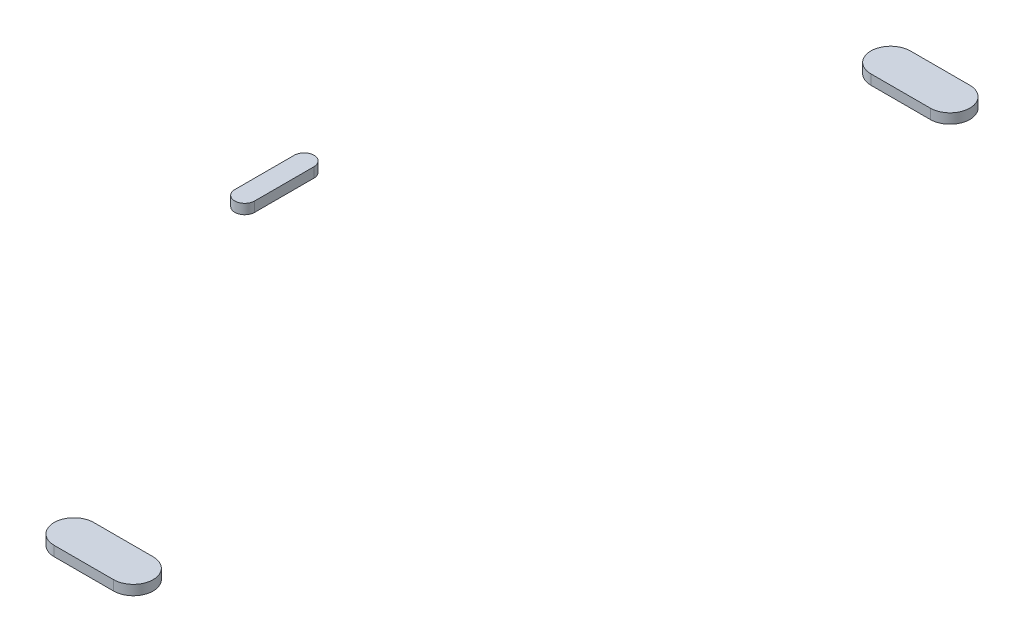
ISO-10303-21;
HEADER;
FILE_DESCRIPTION(('STEP AP214'),'2;1');
FILE_NAME('part.step','',(''),(''),'','','');
FILE_SCHEMA(('AUTOMOTIVE_DESIGN { 1 0 10303 214 1 1 1 1 }'));
ENDSEC;
DATA;
#1=APPLICATION_CONTEXT('core data for automotive mechanical design processes');
#2=APPLICATION_PROTOCOL_DEFINITION('international standard','automotive_design',2000,#1);
#3=PRODUCT_CONTEXT('',#1,'mechanical');
#4=PRODUCT('Part','Part','',(#3));
#5=PRODUCT_RELATED_PRODUCT_CATEGORY('part','',(#4));
#6=PRODUCT_DEFINITION_FORMATION('','',#4);
#7=PRODUCT_DEFINITION_CONTEXT('part definition',#1,'design');
#8=PRODUCT_DEFINITION('design','',#6,#7);
#9=PRODUCT_DEFINITION_SHAPE('','',#8);
#10=(LENGTH_UNIT() NAMED_UNIT(*) SI_UNIT(.MILLI.,.METRE.));
#11=(NAMED_UNIT(*) PLANE_ANGLE_UNIT() SI_UNIT($,.RADIAN.));
#12=(NAMED_UNIT(*) SI_UNIT($,.STERADIAN.) SOLID_ANGLE_UNIT());
#13=UNCERTAINTY_MEASURE_WITH_UNIT(LENGTH_MEASURE(1.E-05),#10,'distance_accuracy_value','');
#14=(GEOMETRIC_REPRESENTATION_CONTEXT(3) GLOBAL_UNCERTAINTY_ASSIGNED_CONTEXT((#13)) GLOBAL_UNIT_ASSIGNED_CONTEXT((#10,
#11,#12)) REPRESENTATION_CONTEXT('',''));
#15=CARTESIAN_POINT('',(0.,0.,0.));
#16=DIRECTION('',(0.,0.,1.));
#17=DIRECTION('',(1.,0.,0.));
#18=AXIS2_PLACEMENT_3D('',#15,#16,#17);
#19=CARTESIAN_POINT('',(0.,-342.9,-249.2375));
#20=DIRECTION('',(0.,0.,1.));
#21=DIRECTION('',(-1.,0.,0.));
#22=AXIS2_PLACEMENT_3D('',#19,#20,#21);
#23=PLANE('',#22);
#24=DIRECTION('',(-1.,0.,0.));
#25=VECTOR('',#24,1.);
#26=CARTESIAN_POINT('',(0.,-336.55,-249.2375));
#27=LINE('',#26,#25);
#28=CARTESIAN_POINT('',(171.45,-336.55,-249.2375));
#29=VERTEX_POINT('',#28);
#30=CARTESIAN_POINT('',(133.35,-336.55,-249.2375));
#31=VERTEX_POINT('',#30);
#32=EDGE_CURVE('E112',#29,#31,#27,.T.);
#33=ORIENTED_EDGE('',*,*,#32,.T.);
#34=DIRECTION('',(0.,1.,0.));
#35=VECTOR('',#34,1.);
#36=CARTESIAN_POINT('',(133.35,-342.9,-249.2375));
#37=LINE('',#36,#35);
#38=CARTESIAN_POINT('',(133.35,-342.9,-249.2375));
#39=VERTEX_POINT('',#38);
#40=EDGE_CURVE('E51',#39,#31,#37,.T.);
#41=ORIENTED_EDGE('',*,*,#40,.F.);
#42=DIRECTION('',(-1.,0.,0.));
#43=VECTOR('',#42,1.);
#44=CARTESIAN_POINT('',(0.,-342.9,-249.2375));
#45=LINE('',#44,#43);
#46=CARTESIAN_POINT('',(171.45,-342.9,-249.2375));
#47=VERTEX_POINT('',#46);
#48=EDGE_CURVE('E101',#47,#39,#45,.T.);
#49=ORIENTED_EDGE('',*,*,#48,.F.);
#50=DIRECTION('',(0.,1.,0.));
#51=VECTOR('',#50,1.);
#52=CARTESIAN_POINT('',(171.45,-342.9,-249.2375));
#53=LINE('',#52,#51);
#54=EDGE_CURVE('E12',#47,#29,#53,.T.);
#55=ORIENTED_EDGE('',*,*,#54,.T.);
#56=EDGE_LOOP('',(#33,#41,#49,#55));
#57=FACE_BOUND('',#56,.T.);
#58=ADVANCED_FACE('F48',(#57),#23,.T.);
#59=CARTESIAN_POINT('',(171.45,-342.9,-261.9375));
#60=DIRECTION('',(0.,1.,0.));
#61=DIRECTION('',(0.,0.,-1.));
#62=AXIS2_PLACEMENT_3D('',#59,#60,#61);
#63=CYLINDRICAL_SURFACE('',#62,12.7);
#64=CARTESIAN_POINT('',(171.45,-336.55,-261.9375));
#65=DIRECTION('',(0.,-1.,0.));
#66=DIRECTION('',(0.,0.,-1.));
#67=AXIS2_PLACEMENT_3D('',#64,#65,#66);
#68=CIRCLE('',#67,12.7);
#69=CARTESIAN_POINT('',(171.45,-336.55,-274.6375));
#70=VERTEX_POINT('',#69);
#71=EDGE_CURVE('E89',#70,#29,#68,.T.);
#72=ORIENTED_EDGE('',*,*,#71,.T.);
#73=ORIENTED_EDGE('',*,*,#54,.F.);
#74=CARTESIAN_POINT('',(171.45,-342.9,-261.9375));
#75=DIRECTION('',(0.,-1.,0.));
#76=DIRECTION('',(0.,0.,-1.));
#77=AXIS2_PLACEMENT_3D('',#74,#75,#76);
#78=CIRCLE('',#77,12.7);
#79=CARTESIAN_POINT('',(171.45,-342.9,-274.6375));
#80=VERTEX_POINT('',#79);
#81=EDGE_CURVE('E66',#80,#47,#78,.T.);
#82=ORIENTED_EDGE('',*,*,#81,.F.);
#83=DIRECTION('',(0.,1.,0.));
#84=VECTOR('',#83,1.);
#85=CARTESIAN_POINT('',(171.45,-342.9,-274.6375));
#86=LINE('',#85,#84);
#87=EDGE_CURVE('E57',#80,#70,#86,.T.);
#88=ORIENTED_EDGE('',*,*,#87,.T.);
#89=EDGE_LOOP('',(#72,#73,#82,#88));
#90=FACE_BOUND('',#89,.T.);
#91=ADVANCED_FACE('F118',(#90),#63,.T.);
#92=CARTESIAN_POINT('',(0.,-342.9,-274.6375));
#93=DIRECTION('',(0.,0.,1.));
#94=DIRECTION('',(-1.,0.,0.));
#95=AXIS2_PLACEMENT_3D('',#92,#93,#94);
#96=PLANE('',#95);
#97=DIRECTION('',(-1.,0.,0.));
#98=VECTOR('',#97,1.);
#99=CARTESIAN_POINT('',(0.,-336.55,-274.6375));
#100=LINE('',#99,#98);
#101=CARTESIAN_POINT('',(133.35,-336.55,-274.6375));
#102=VERTEX_POINT('',#101);
#103=EDGE_CURVE('E83',#70,#102,#100,.T.);
#104=ORIENTED_EDGE('',*,*,#103,.F.);
#105=ORIENTED_EDGE('',*,*,#87,.F.);
#106=DIRECTION('',(-1.,0.,0.));
#107=VECTOR('',#106,1.);
#108=CARTESIAN_POINT('',(0.,-342.9,-274.6375));
#109=LINE('',#108,#107);
#110=CARTESIAN_POINT('',(133.35,-342.9,-274.6375));
#111=VERTEX_POINT('',#110);
#112=EDGE_CURVE('E99',#80,#111,#109,.T.);
#113=ORIENTED_EDGE('',*,*,#112,.T.);
#114=DIRECTION('',(0.,1.,0.));
#115=VECTOR('',#114,1.);
#116=CARTESIAN_POINT('',(133.35,-342.9,-274.6375));
#117=LINE('',#116,#115);
#118=EDGE_CURVE('E104',#111,#102,#117,.T.);
#119=ORIENTED_EDGE('',*,*,#118,.T.);
#120=EDGE_LOOP('',(#104,#105,#113,#119));
#121=FACE_BOUND('',#120,.T.);
#122=ADVANCED_FACE('F107',(#121),#96,.F.);
#123=CARTESIAN_POINT('',(133.35,-342.9,-261.9375));
#124=DIRECTION('',(0.,1.,0.));
#125=DIRECTION('',(0.,0.,-1.));
#126=AXIS2_PLACEMENT_3D('',#123,#124,#125);
#127=CYLINDRICAL_SURFACE('',#126,12.7);
#128=CARTESIAN_POINT('',(133.35,-336.55,-261.9375));
#129=DIRECTION('',(0.,-1.,0.));
#130=DIRECTION('',(0.,0.,-1.));
#131=AXIS2_PLACEMENT_3D('',#128,#129,#130);
#132=CIRCLE('',#131,12.7);
#133=EDGE_CURVE('E106',#31,#102,#132,.T.);
#134=ORIENTED_EDGE('',*,*,#133,.T.);
#135=ORIENTED_EDGE('',*,*,#118,.F.);
#136=CARTESIAN_POINT('',(133.35,-342.9,-261.9375));
#137=DIRECTION('',(0.,-1.,0.));
#138=DIRECTION('',(0.,0.,-1.));
#139=AXIS2_PLACEMENT_3D('',#136,#137,#138);
#140=CIRCLE('',#139,12.7);
#141=EDGE_CURVE('E96',#39,#111,#140,.T.);
#142=ORIENTED_EDGE('',*,*,#141,.F.);
#143=ORIENTED_EDGE('',*,*,#40,.T.);
#144=EDGE_LOOP('',(#134,#135,#142,#143));
#145=FACE_BOUND('',#144,.T.);
#146=ADVANCED_FACE('F105',(#145),#127,.T.);
#147=CARTESIAN_POINT('',(0.,-342.9,0.));
#148=DIRECTION('',(0.,1.,0.));
#149=DIRECTION('',(0.,0.,-1.));
#150=AXIS2_PLACEMENT_3D('',#147,#148,#149);
#151=PLANE('',#150);
#152=ORIENTED_EDGE('',*,*,#48,.T.);
#153=ORIENTED_EDGE('',*,*,#141,.T.);
#154=ORIENTED_EDGE('',*,*,#112,.F.);
#155=ORIENTED_EDGE('',*,*,#81,.T.);
#156=EDGE_LOOP('',(#152,#153,#154,#155));
#157=FACE_BOUND('',#156,.T.);
#158=ADVANCED_FACE('F97',(#157),#151,.F.);
#159=CARTESIAN_POINT('',(0.,-336.55,0.));
#160=DIRECTION('',(0.,1.,0.));
#161=DIRECTION('',(0.,0.,-1.));
#162=AXIS2_PLACEMENT_3D('',#159,#160,#161);
#163=PLANE('',#162);
#164=ORIENTED_EDGE('',*,*,#32,.F.);
#165=ORIENTED_EDGE('',*,*,#71,.F.);
#166=ORIENTED_EDGE('',*,*,#103,.T.);
#167=ORIENTED_EDGE('',*,*,#133,.F.);
#168=EDGE_LOOP('',(#164,#165,#166,#167));
#169=FACE_BOUND('',#168,.T.);
#170=ADVANCED_FACE('F121',(#169),#163,.T.);
#171=CLOSED_SHELL('',(#58,#91,#122,#146,#158,#170));
#172=MANIFOLD_SOLID_BREP('B2',#171);
#173=CARTESIAN_POINT('',(0.,-342.9,19.05));
#174=DIRECTION('',(0.,1.,0.));
#175=DIRECTION('',(0.,0.,1.));
#176=AXIS2_PLACEMENT_3D('',#173,#174,#175);
#177=CYLINDRICAL_SURFACE('',#176,6.35);
#178=CARTESIAN_POINT('',(0.,-336.55,19.05));
#179=DIRECTION('',(0.,1.,0.));
#180=DIRECTION('',(0.,0.,1.));
#181=AXIS2_PLACEMENT_3D('',#178,#179,#180);
#182=CIRCLE('',#181,6.35);
#183=CARTESIAN_POINT('',(-6.35,-336.55,19.05));
#184=VERTEX_POINT('',#183);
#185=CARTESIAN_POINT('',(6.35,-336.55,19.05));
#186=VERTEX_POINT('',#185);
#187=EDGE_CURVE('E46',#184,#186,#182,.T.);
#188=ORIENTED_EDGE('',*,*,#187,.F.);
#189=DIRECTION('',(0.,1.,0.));
#190=VECTOR('',#189,1.);
#191=CARTESIAN_POINT('',(-6.35,-342.9,19.05));
#192=LINE('',#191,#190);
#193=CARTESIAN_POINT('',(-6.35,-342.9,19.05));
#194=VERTEX_POINT('',#193);
#195=EDGE_CURVE('E252',#194,#184,#192,.T.);
#196=ORIENTED_EDGE('',*,*,#195,.F.);
#197=CARTESIAN_POINT('',(0.,-342.9,19.05));
#198=DIRECTION('',(0.,1.,0.));
#199=DIRECTION('',(0.,0.,1.));
#200=AXIS2_PLACEMENT_3D('',#197,#198,#199);
#201=CIRCLE('',#200,6.35);
#202=CARTESIAN_POINT('',(6.35,-342.9,19.05));
#203=VERTEX_POINT('',#202);
#204=EDGE_CURVE('E209',#194,#203,#201,.T.);
#205=ORIENTED_EDGE('',*,*,#204,.T.);
#206=DIRECTION('',(0.,1.,0.));
#207=VECTOR('',#206,1.);
#208=CARTESIAN_POINT('',(6.35,-342.9,19.05));
#209=LINE('',#208,#207);
#210=EDGE_CURVE('E224',#203,#186,#209,.T.);
#211=ORIENTED_EDGE('',*,*,#210,.T.);
#212=EDGE_LOOP('',(#188,#196,#205,#211));
#213=FACE_BOUND('',#212,.T.);
#214=ADVANCED_FACE('F205',(#213),#177,.T.);
#215=CARTESIAN_POINT('',(-6.35,-342.9,19.05));
#216=DIRECTION('',(1.,0.,0.));
#217=DIRECTION('',(0.,0.,-1.));
#218=AXIS2_PLACEMENT_3D('',#215,#216,#217);
#219=PLANE('',#218);
#220=DIRECTION('',(0.,0.,-1.));
#221=VECTOR('',#220,1.);
#222=CARTESIAN_POINT('',(-6.35,-336.55,19.05));
#223=LINE('',#222,#221);
#224=CARTESIAN_POINT('',(-6.35000000000001,-336.55,-19.05));
#225=VERTEX_POINT('',#224);
#226=EDGE_CURVE('E263',#184,#225,#223,.T.);
#227=ORIENTED_EDGE('',*,*,#226,.T.);
#228=DIRECTION('',(0.,1.,0.));
#229=VECTOR('',#228,1.);
#230=CARTESIAN_POINT('',(-6.35000000000001,-342.9,-19.05));
#231=LINE('',#230,#229);
#232=CARTESIAN_POINT('',(-6.35000000000001,-342.9,-19.05));
#233=VERTEX_POINT('',#232);
#234=EDGE_CURVE('E256',#233,#225,#231,.T.);
#235=ORIENTED_EDGE('',*,*,#234,.F.);
#236=DIRECTION('',(0.,0.,-1.));
#237=VECTOR('',#236,1.);
#238=CARTESIAN_POINT('',(-6.35,-342.9,19.05));
#239=LINE('',#238,#237);
#240=EDGE_CURVE('E272',#194,#233,#239,.T.);
#241=ORIENTED_EDGE('',*,*,#240,.F.);
#242=ORIENTED_EDGE('',*,*,#195,.T.);
#243=EDGE_LOOP('',(#227,#235,#241,#242));
#244=FACE_BOUND('',#243,.T.);
#245=ADVANCED_FACE('F264',(#244),#219,.F.);
#246=CARTESIAN_POINT('',(0.,-342.9,-19.05));
#247=DIRECTION('',(0.,1.,0.));
#248=DIRECTION('',(0.,0.,1.));
#249=AXIS2_PLACEMENT_3D('',#246,#247,#248);
#250=CYLINDRICAL_SURFACE('',#249,6.35);
#251=CARTESIAN_POINT('',(0.,-336.55,-19.05));
#252=DIRECTION('',(0.,1.,0.));
#253=DIRECTION('',(0.,0.,1.));
#254=AXIS2_PLACEMENT_3D('',#251,#252,#253);
#255=CIRCLE('',#254,6.35);
#256=CARTESIAN_POINT('',(6.34999999999999,-336.55,-19.05));
#257=VERTEX_POINT('',#256);
#258=EDGE_CURVE('E259',#257,#225,#255,.T.);
#259=ORIENTED_EDGE('',*,*,#258,.F.);
#260=DIRECTION('',(0.,1.,0.));
#261=VECTOR('',#260,1.);
#262=CARTESIAN_POINT('',(6.34999999999999,-342.9,-19.05));
#263=LINE('',#262,#261);
#264=CARTESIAN_POINT('',(6.34999999999999,-342.9,-19.05));
#265=VERTEX_POINT('',#264);
#266=EDGE_CURVE('E241',#265,#257,#263,.T.);
#267=ORIENTED_EDGE('',*,*,#266,.F.);
#268=CARTESIAN_POINT('',(0.,-342.9,-19.05));
#269=DIRECTION('',(0.,1.,0.));
#270=DIRECTION('',(0.,0.,1.));
#271=AXIS2_PLACEMENT_3D('',#268,#269,#270);
#272=CIRCLE('',#271,6.35);
#273=EDGE_CURVE('E261',#265,#233,#272,.T.);
#274=ORIENTED_EDGE('',*,*,#273,.T.);
#275=ORIENTED_EDGE('',*,*,#234,.T.);
#276=EDGE_LOOP('',(#259,#267,#274,#275));
#277=FACE_BOUND('',#276,.T.);
#278=ADVANCED_FACE('F257',(#277),#250,.T.);
#279=CARTESIAN_POINT('',(6.35,-342.9,19.05));
#280=DIRECTION('',(1.,0.,0.));
#281=DIRECTION('',(0.,0.,-1.));
#282=AXIS2_PLACEMENT_3D('',#279,#280,#281);
#283=PLANE('',#282);
#284=DIRECTION('',(0.,0.,-1.));
#285=VECTOR('',#284,1.);
#286=CARTESIAN_POINT('',(6.35,-336.55,19.05));
#287=LINE('',#286,#285);
#288=EDGE_CURVE('E215',#186,#257,#287,.T.);
#289=ORIENTED_EDGE('',*,*,#288,.F.);
#290=ORIENTED_EDGE('',*,*,#210,.F.);
#291=DIRECTION('',(0.,0.,-1.));
#292=VECTOR('',#291,1.);
#293=CARTESIAN_POINT('',(6.35,-342.9,19.05));
#294=LINE('',#293,#292);
#295=EDGE_CURVE('E274',#203,#265,#294,.T.);
#296=ORIENTED_EDGE('',*,*,#295,.T.);
#297=ORIENTED_EDGE('',*,*,#266,.T.);
#298=EDGE_LOOP('',(#289,#290,#296,#297));
#299=FACE_BOUND('',#298,.T.);
#300=ADVANCED_FACE('F278',(#299),#283,.T.);
#301=CARTESIAN_POINT('',(0.,-342.9,19.05));
#302=DIRECTION('',(0.,1.,0.));
#303=DIRECTION('',(0.,0.,1.));
#304=AXIS2_PLACEMENT_3D('',#301,#302,#303);
#305=PLANE('',#304);
#306=ORIENTED_EDGE('',*,*,#204,.F.);
#307=ORIENTED_EDGE('',*,*,#240,.T.);
#308=ORIENTED_EDGE('',*,*,#273,.F.);
#309=ORIENTED_EDGE('',*,*,#295,.F.);
#310=EDGE_LOOP('',(#306,#307,#308,#309));
#311=FACE_BOUND('',#310,.T.);
#312=ADVANCED_FACE('F207',(#311),#305,.F.);
#313=CARTESIAN_POINT('',(0.,-336.55,19.05));
#314=DIRECTION('',(0.,1.,0.));
#315=DIRECTION('',(0.,0.,1.));
#316=AXIS2_PLACEMENT_3D('',#313,#314,#315);
#317=PLANE('',#316);
#318=ORIENTED_EDGE('',*,*,#187,.T.);
#319=ORIENTED_EDGE('',*,*,#288,.T.);
#320=ORIENTED_EDGE('',*,*,#258,.T.);
#321=ORIENTED_EDGE('',*,*,#226,.F.);
#322=EDGE_LOOP('',(#318,#319,#320,#321));
#323=FACE_BOUND('',#322,.T.);
#324=ADVANCED_FACE('F267',(#323),#317,.T.);
#325=CLOSED_SHELL('',(#214,#245,#278,#300,#312,#324));
#326=MANIFOLD_SOLID_BREP('B6',#325);
#327=CARTESIAN_POINT('',(0.,-342.9,249.2375));
#328=DIRECTION('',(0.,0.,-1.));
#329=DIRECTION('',(-1.,0.,0.));
#330=AXIS2_PLACEMENT_3D('',#327,#328,#329);
#331=PLANE('',#330);
#332=DIRECTION('',(-1.,0.,0.));
#333=VECTOR('',#332,1.);
#334=CARTESIAN_POINT('',(0.,-336.55,249.2375));
#335=LINE('',#334,#333);
#336=CARTESIAN_POINT('',(171.45,-336.55,249.2375));
#337=VERTEX_POINT('',#336);
#338=CARTESIAN_POINT('',(133.35,-336.55,249.2375));
#339=VERTEX_POINT('',#338);
#340=EDGE_CURVE('E393',#337,#339,#335,.T.);
#341=ORIENTED_EDGE('',*,*,#340,.F.);
#342=DIRECTION('',(0.,1.,0.));
#343=VECTOR('',#342,1.);
#344=CARTESIAN_POINT('',(171.45,-342.9,249.2375));
#345=LINE('',#344,#343);
#346=CARTESIAN_POINT('',(171.45,-342.9,249.2375));
#347=VERTEX_POINT('',#346);
#348=EDGE_CURVE('E203',#347,#337,#345,.T.);
#349=ORIENTED_EDGE('',*,*,#348,.F.);
#350=DIRECTION('',(-1.,0.,0.));
#351=VECTOR('',#350,1.);
#352=CARTESIAN_POINT('',(0.,-342.9,249.2375));
#353=LINE('',#352,#351);
#354=CARTESIAN_POINT('',(133.35,-342.9,249.2375));
#355=VERTEX_POINT('',#354);
#356=EDGE_CURVE('E387',#347,#355,#353,.T.);
#357=ORIENTED_EDGE('',*,*,#356,.T.);
#358=DIRECTION('',(0.,1.,0.));
#359=VECTOR('',#358,1.);
#360=CARTESIAN_POINT('',(133.35,-342.9,249.2375));
#361=LINE('',#360,#359);
#362=EDGE_CURVE('E332',#355,#339,#361,.T.);
#363=ORIENTED_EDGE('',*,*,#362,.T.);
#364=EDGE_LOOP('',(#341,#349,#357,#363));
#365=FACE_BOUND('',#364,.T.);
#366=ADVANCED_FACE('F329',(#365),#331,.T.);
#367=CARTESIAN_POINT('',(171.45,-342.9,261.9375));
#368=DIRECTION('',(0.,1.,0.));
#369=DIRECTION('',(0.,0.,1.));
#370=AXIS2_PLACEMENT_3D('',#367,#368,#369);
#371=CYLINDRICAL_SURFACE('',#370,12.7);
#372=CARTESIAN_POINT('',(171.45,-336.55,261.9375));
#373=DIRECTION('',(0.,1.,0.));
#374=DIRECTION('',(0.,0.,1.));
#375=AXIS2_PLACEMENT_3D('',#372,#373,#374);
#376=CIRCLE('',#375,12.7);
#377=CARTESIAN_POINT('',(171.45,-336.55,274.6375));
#378=VERTEX_POINT('',#377);
#379=EDGE_CURVE('E389',#378,#337,#376,.T.);
#380=ORIENTED_EDGE('',*,*,#379,.F.);
#381=DIRECTION('',(0.,1.,0.));
#382=VECTOR('',#381,1.);
#383=CARTESIAN_POINT('',(171.45,-342.9,274.6375));
#384=LINE('',#383,#382);
#385=CARTESIAN_POINT('',(171.45,-342.9,274.6375));
#386=VERTEX_POINT('',#385);
#387=EDGE_CURVE('E338',#386,#378,#384,.T.);
#388=ORIENTED_EDGE('',*,*,#387,.F.);
#389=CARTESIAN_POINT('',(171.45,-342.9,261.9375));
#390=DIRECTION('',(0.,1.,0.));
#391=DIRECTION('',(0.,0.,1.));
#392=AXIS2_PLACEMENT_3D('',#389,#390,#391);
#393=CIRCLE('',#392,12.7);
#394=EDGE_CURVE('E380',#386,#347,#393,.T.);
#395=ORIENTED_EDGE('',*,*,#394,.T.);
#396=ORIENTED_EDGE('',*,*,#348,.T.);
#397=EDGE_LOOP('',(#380,#388,#395,#396));
#398=FACE_BOUND('',#397,.T.);
#399=ADVANCED_FACE('F403',(#398),#371,.T.);
#400=CARTESIAN_POINT('',(0.,-342.9,274.6375));
#401=DIRECTION('',(0.,0.,-1.));
#402=DIRECTION('',(-1.,0.,0.));
#403=AXIS2_PLACEMENT_3D('',#400,#401,#402);
#404=PLANE('',#403);
#405=DIRECTION('',(-1.,0.,0.));
#406=VECTOR('',#405,1.);
#407=CARTESIAN_POINT('',(0.,-336.55,274.6375));
#408=LINE('',#407,#406);
#409=CARTESIAN_POINT('',(133.35,-336.55,274.6375));
#410=VERTEX_POINT('',#409);
#411=EDGE_CURVE('E384',#378,#410,#408,.T.);
#412=ORIENTED_EDGE('',*,*,#411,.T.);
#413=DIRECTION('',(0.,1.,0.));
#414=VECTOR('',#413,1.);
#415=CARTESIAN_POINT('',(133.35,-342.9,274.6375));
#416=LINE('',#415,#414);
#417=CARTESIAN_POINT('',(133.35,-342.9,274.6375));
#418=VERTEX_POINT('',#417);
#419=EDGE_CURVE('E382',#418,#410,#416,.T.);
#420=ORIENTED_EDGE('',*,*,#419,.F.);
#421=DIRECTION('',(-1.,0.,0.));
#422=VECTOR('',#421,1.);
#423=CARTESIAN_POINT('',(0.,-342.9,274.6375));
#424=LINE('',#423,#422);
#425=EDGE_CURVE('E376',#386,#418,#424,.T.);
#426=ORIENTED_EDGE('',*,*,#425,.F.);
#427=ORIENTED_EDGE('',*,*,#387,.T.);
#428=EDGE_LOOP('',(#412,#420,#426,#427));
#429=FACE_BOUND('',#428,.T.);
#430=ADVANCED_FACE('F383',(#429),#404,.F.);
#431=CARTESIAN_POINT('',(133.35,-342.9,261.9375));
#432=DIRECTION('',(0.,1.,0.));
#433=DIRECTION('',(0.,0.,1.));
#434=AXIS2_PLACEMENT_3D('',#431,#432,#433);
#435=CYLINDRICAL_SURFACE('',#434,12.7);
#436=CARTESIAN_POINT('',(133.35,-336.55,261.9375));
#437=DIRECTION('',(0.,1.,0.));
#438=DIRECTION('',(0.,0.,1.));
#439=AXIS2_PLACEMENT_3D('',#436,#437,#438);
#440=CIRCLE('',#439,12.7);
#441=EDGE_CURVE('E396',#339,#410,#440,.T.);
#442=ORIENTED_EDGE('',*,*,#441,.F.);
#443=ORIENTED_EDGE('',*,*,#362,.F.);
#444=CARTESIAN_POINT('',(133.35,-342.9,261.9375));
#445=DIRECTION('',(0.,1.,0.));
#446=DIRECTION('',(0.,0.,1.));
#447=AXIS2_PLACEMENT_3D('',#444,#445,#446);
#448=CIRCLE('',#447,12.7);
#449=EDGE_CURVE('E379',#355,#418,#448,.T.);
#450=ORIENTED_EDGE('',*,*,#449,.T.);
#451=ORIENTED_EDGE('',*,*,#419,.T.);
#452=EDGE_LOOP('',(#442,#443,#450,#451));
#453=FACE_BOUND('',#452,.T.);
#454=ADVANCED_FACE('F386',(#453),#435,.T.);
#455=CARTESIAN_POINT('',(0.,-342.9,0.));
#456=DIRECTION('',(0.,1.,0.));
#457=DIRECTION('',(0.,0.,1.));
#458=AXIS2_PLACEMENT_3D('',#455,#456,#457);
#459=PLANE('',#458);
#460=ORIENTED_EDGE('',*,*,#356,.F.);
#461=ORIENTED_EDGE('',*,*,#394,.F.);
#462=ORIENTED_EDGE('',*,*,#425,.T.);
#463=ORIENTED_EDGE('',*,*,#449,.F.);
#464=EDGE_LOOP('',(#460,#461,#462,#463));
#465=FACE_BOUND('',#464,.T.);
#466=ADVANCED_FACE('F378',(#465),#459,.F.);
#467=CARTESIAN_POINT('',(0.,-336.55,0.));
#468=DIRECTION('',(0.,1.,0.));
#469=DIRECTION('',(0.,0.,1.));
#470=AXIS2_PLACEMENT_3D('',#467,#468,#469);
#471=PLANE('',#470);
#472=ORIENTED_EDGE('',*,*,#340,.T.);
#473=ORIENTED_EDGE('',*,*,#441,.T.);
#474=ORIENTED_EDGE('',*,*,#411,.F.);
#475=ORIENTED_EDGE('',*,*,#379,.T.);
#476=EDGE_LOOP('',(#472,#473,#474,#475));
#477=FACE_BOUND('',#476,.T.);
#478=ADVANCED_FACE('F402',(#477),#471,.T.);
#479=CLOSED_SHELL('',(#366,#399,#430,#454,#466,#478));
#480=MANIFOLD_SOLID_BREP('B40',#479);
#481=ADVANCED_BREP_SHAPE_REPRESENTATION('',(#18,#172,#326,#480),#14);
#482=SHAPE_DEFINITION_REPRESENTATION(#9,#481);
ENDSEC;
END-ISO-10303-21;
